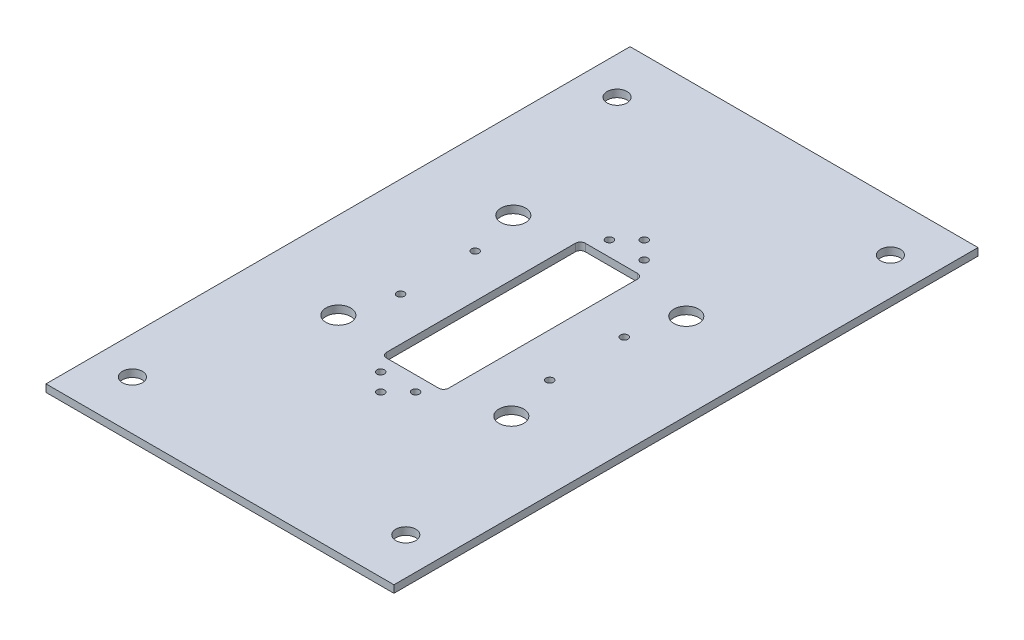
ISO-10303-21;
HEADER;
FILE_DESCRIPTION(('STEP AP214'),'2;1');
FILE_NAME('part.step','',(''),(''),'','','');
FILE_SCHEMA(('AUTOMOTIVE_DESIGN { 1 0 10303 214 1 1 1 1 }'));
ENDSEC;
DATA;
#1=APPLICATION_CONTEXT('core data for automotive mechanical design processes');
#2=APPLICATION_PROTOCOL_DEFINITION('international standard','automotive_design',2000,#1);
#3=PRODUCT_CONTEXT('',#1,'mechanical');
#4=PRODUCT('Part','Part','',(#3));
#5=PRODUCT_RELATED_PRODUCT_CATEGORY('part','',(#4));
#6=PRODUCT_DEFINITION_FORMATION('','',#4);
#7=PRODUCT_DEFINITION_CONTEXT('part definition',#1,'design');
#8=PRODUCT_DEFINITION('design','',#6,#7);
#9=PRODUCT_DEFINITION_SHAPE('','',#8);
#10=(LENGTH_UNIT() NAMED_UNIT(*) SI_UNIT(.MILLI.,.METRE.));
#11=(NAMED_UNIT(*) PLANE_ANGLE_UNIT() SI_UNIT($,.RADIAN.));
#12=(NAMED_UNIT(*) SI_UNIT($,.STERADIAN.) SOLID_ANGLE_UNIT());
#13=UNCERTAINTY_MEASURE_WITH_UNIT(LENGTH_MEASURE(1.E-05),#10,'distance_accuracy_value','');
#14=(GEOMETRIC_REPRESENTATION_CONTEXT(3) GLOBAL_UNCERTAINTY_ASSIGNED_CONTEXT((#13)) GLOBAL_UNIT_ASSIGNED_CONTEXT((#10,
#11,#12)) REPRESENTATION_CONTEXT('',''));
#15=CARTESIAN_POINT('',(0.,0.,0.));
#16=DIRECTION('',(0.,0.,1.));
#17=DIRECTION('',(1.,0.,0.));
#18=AXIS2_PLACEMENT_3D('',#15,#16,#17);
#19=CARTESIAN_POINT('',(0.,0.,0.));
#20=DIRECTION('',(0.,1.,0.));
#21=DIRECTION('',(0.,0.,1.));
#22=AXIS2_PLACEMENT_3D('',#19,#20,#21);
#23=PLANE('',#22);
#24=CARTESIAN_POINT('',(54.9999999999992,0.,97.7319085566605));
#25=DIRECTION('',(0.,-1.,0.));
#26=DIRECTION('',(0.,0.,-1.));
#27=AXIS2_PLACEMENT_3D('',#24,#25,#26);
#28=CIRCLE('',#27,4.0000000000027);
#29=CARTESIAN_POINT('',(54.9999999999992,0.,93.7319085566578));
#30=VERTEX_POINT('',#29);
#31=EDGE_CURVE('E216',#30,#30,#28,.F.);
#32=ORIENTED_EDGE('',*,*,#31,.T.);
#33=EDGE_LOOP('',(#32));
#34=FACE_BOUND('',#33,.T.);
#35=CARTESIAN_POINT('',(-55.0000000000008,0.,97.7319085566613));
#36=DIRECTION('',(0.,-1.,0.));
#37=DIRECTION('',(0.,0.,-1.));
#38=AXIS2_PLACEMENT_3D('',#35,#36,#37);
#39=CIRCLE('',#38,4.0000000000027);
#40=CARTESIAN_POINT('',(-55.0000000000008,0.,93.7319085566586));
#41=VERTEX_POINT('',#40);
#42=EDGE_CURVE('E19',#41,#41,#39,.F.);
#43=ORIENTED_EDGE('',*,*,#42,.T.);
#44=EDGE_LOOP('',(#43));
#45=FACE_BOUND('',#44,.T.);
#46=CARTESIAN_POINT('',(-55.0000000000028,0.,-97.2680914433387));
#47=DIRECTION('',(0.,-1.,0.));
#48=DIRECTION('',(0.,0.,-1.));
#49=AXIS2_PLACEMENT_3D('',#46,#47,#48);
#50=CIRCLE('',#49,4.0000000000027);
#51=CARTESIAN_POINT('',(-55.0000000000028,0.,-101.268091443341));
#52=VERTEX_POINT('',#51);
#53=EDGE_CURVE('E219',#52,#52,#50,.F.);
#54=ORIENTED_EDGE('',*,*,#53,.T.);
#55=EDGE_LOOP('',(#54));
#56=FACE_BOUND('',#55,.T.);
#57=CARTESIAN_POINT('',(54.9999999999958,0.,-97.2680914433395));
#58=DIRECTION('',(0.,-1.,0.));
#59=DIRECTION('',(0.,0.,-1.));
#60=AXIS2_PLACEMENT_3D('',#57,#58,#59);
#61=CIRCLE('',#60,4.00000000000403);
#62=CARTESIAN_POINT('',(54.9999999999958,0.,-101.268091443344));
#63=VERTEX_POINT('',#62);
#64=EDGE_CURVE('E272',#63,#63,#61,.F.);
#65=ORIENTED_EDGE('',*,*,#64,.T.);
#66=EDGE_LOOP('',(#65));
#67=FACE_BOUND('',#66,.T.);
#68=CARTESIAN_POINT('',(-35.1423190407129,0.,34.7416446339251));
#69=DIRECTION('',(0.,-1.,0.));
#70=DIRECTION('',(0.,0.,-1.));
#71=AXIS2_PLACEMENT_3D('',#68,#69,#70);
#72=CIRCLE('',#71,5.);
#73=CARTESIAN_POINT('',(-35.1423190407129,0.,29.7416446339251));
#74=VERTEX_POINT('',#73);
#75=EDGE_CURVE('E222',#74,#74,#72,.F.);
#76=ORIENTED_EDGE('',*,*,#75,.T.);
#77=EDGE_LOOP('',(#76));
#78=FACE_BOUND('',#77,.T.);
#79=CARTESIAN_POINT('',(34.8601227281781,0.,35.1393208369611));
#80=DIRECTION('',(0.,-1.,0.));
#81=DIRECTION('',(0.,0.,-1.));
#82=AXIS2_PLACEMENT_3D('',#79,#80,#81);
#83=CIRCLE('',#82,5.);
#84=CARTESIAN_POINT('',(34.8601227281781,0.,30.1393208369611));
#85=VERTEX_POINT('',#84);
#86=EDGE_CURVE('E270',#85,#85,#83,.F.);
#87=ORIENTED_EDGE('',*,*,#86,.T.);
#88=EDGE_LOOP('',(#87));
#89=FACE_BOUND('',#88,.T.);
#90=CARTESIAN_POINT('',(35.2577989313261,0.,-34.8631209321479));
#91=DIRECTION('',(0.,-1.,0.));
#92=DIRECTION('',(0.,0.,-1.));
#93=AXIS2_PLACEMENT_3D('',#90,#91,#92);
#94=CIRCLE('',#93,5.);
#95=CARTESIAN_POINT('',(35.2577989313261,0.,-39.8631209321479));
#96=VERTEX_POINT('',#95);
#97=EDGE_CURVE('E225',#96,#96,#94,.F.);
#98=ORIENTED_EDGE('',*,*,#97,.T.);
#99=EDGE_LOOP('',(#98));
#100=FACE_BOUND('',#99,.T.);
#101=CARTESIAN_POINT('',(-34.7446428377839,0.,-35.2607971352949));
#102=DIRECTION('',(0.,-1.,0.));
#103=DIRECTION('',(0.,0.,-1.));
#104=AXIS2_PLACEMENT_3D('',#101,#102,#103);
#105=CIRCLE('',#104,5.);
#106=CARTESIAN_POINT('',(-34.7446428377839,0.,-40.2607971352949));
#107=VERTEX_POINT('',#106);
#108=EDGE_CURVE('E267',#107,#107,#105,.F.);
#109=ORIENTED_EDGE('',*,*,#108,.T.);
#110=EDGE_LOOP('',(#109));
#111=FACE_BOUND('',#110,.T.);
#112=DIRECTION('',(-1.,0.,0.));
#113=VECTOR('',#112,1.);
#114=CARTESIAN_POINT('',(-10.5,0.,40.));
#115=LINE('',#114,#113);
#116=CARTESIAN_POINT('',(10.5,0.,40.));
#117=VERTEX_POINT('',#116);
#118=CARTESIAN_POINT('',(-10.5,0.,40.));
#119=VERTEX_POINT('',#118);
#120=EDGE_CURVE('E89',#117,#119,#115,.T.);
#121=ORIENTED_EDGE('',*,*,#120,.F.);
#122=CARTESIAN_POINT('',(10.5,0.,38.));
#123=DIRECTION('',(0.,-1.,0.));
#124=DIRECTION('',(0.,0.,-1.));
#125=AXIS2_PLACEMENT_3D('',#122,#123,#124);
#126=CIRCLE('',#125,2.);
#127=CARTESIAN_POINT('',(12.5,0.,38.));
#128=VERTEX_POINT('',#127);
#129=EDGE_CURVE('E228',#117,#128,#126,.F.);
#130=ORIENTED_EDGE('',*,*,#129,.T.);
#131=DIRECTION('',(0.,0.,1.));
#132=VECTOR('',#131,1.);
#133=CARTESIAN_POINT('',(12.5,0.,38.));
#134=LINE('',#133,#132);
#135=CARTESIAN_POINT('',(12.5,0.,-38.));
#136=VERTEX_POINT('',#135);
#137=EDGE_CURVE('E137',#136,#128,#134,.T.);
#138=ORIENTED_EDGE('',*,*,#137,.F.);
#139=CARTESIAN_POINT('',(10.5,0.,-38.));
#140=DIRECTION('',(0.,-1.,0.));
#141=DIRECTION('',(0.,0.,-1.));
#142=AXIS2_PLACEMENT_3D('',#139,#140,#141);
#143=CIRCLE('',#142,2.);
#144=CARTESIAN_POINT('',(10.5,0.,-40.));
#145=VERTEX_POINT('',#144);
#146=EDGE_CURVE('E140',#136,#145,#143,.F.);
#147=ORIENTED_EDGE('',*,*,#146,.T.);
#148=DIRECTION('',(1.,0.,0.));
#149=VECTOR('',#148,1.);
#150=CARTESIAN_POINT('',(-10.5,0.,-40.));
#151=LINE('',#150,#149);
#152=CARTESIAN_POINT('',(-10.5,0.,-40.));
#153=VERTEX_POINT('',#152);
#154=EDGE_CURVE('E141',#153,#145,#151,.T.);
#155=ORIENTED_EDGE('',*,*,#154,.F.);
#156=CARTESIAN_POINT('',(-10.5,0.,-38.));
#157=DIRECTION('',(0.,-1.,0.));
#158=DIRECTION('',(0.,0.,-1.));
#159=AXIS2_PLACEMENT_3D('',#156,#157,#158);
#160=CIRCLE('',#159,2.);
#161=CARTESIAN_POINT('',(-12.5,0.,-38.));
#162=VERTEX_POINT('',#161);
#163=EDGE_CURVE('E144',#153,#162,#160,.F.);
#164=ORIENTED_EDGE('',*,*,#163,.T.);
#165=DIRECTION('',(0.,0.,-1.));
#166=VECTOR('',#165,1.);
#167=CARTESIAN_POINT('',(-12.5,0.,38.));
#168=LINE('',#167,#166);
#169=CARTESIAN_POINT('',(-12.5,0.,38.));
#170=VERTEX_POINT('',#169);
#171=EDGE_CURVE('E83',#170,#162,#168,.T.);
#172=ORIENTED_EDGE('',*,*,#171,.F.);
#173=CARTESIAN_POINT('',(-10.5,0.,38.));
#174=DIRECTION('',(0.,-1.,0.));
#175=DIRECTION('',(0.,0.,-1.));
#176=AXIS2_PLACEMENT_3D('',#173,#174,#175);
#177=CIRCLE('',#176,2.);
#178=EDGE_CURVE('E146',#170,#119,#177,.F.);
#179=ORIENTED_EDGE('',*,*,#178,.T.);
#180=EDGE_LOOP('',(#121,#130,#138,#147,#155,#164,#172,#179));
#181=FACE_BOUND('',#180,.T.);
#182=DIRECTION('',(-1.,0.,0.));
#183=VECTOR('',#182,1.);
#184=CARTESIAN_POINT('',(-70.0000000000028,0.,117.5));
#185=LINE('',#184,#183);
#186=CARTESIAN_POINT('',(69.9999999999958,0.,117.5));
#187=VERTEX_POINT('',#186);
#188=CARTESIAN_POINT('',(-70.0000000000028,0.,117.5));
#189=VERTEX_POINT('',#188);
#190=EDGE_CURVE('E252',#187,#189,#185,.T.);
#191=ORIENTED_EDGE('',*,*,#190,.T.);
#192=DIRECTION('',(0.,0.,-1.));
#193=VECTOR('',#192,1.);
#194=CARTESIAN_POINT('',(-70.0000000000029,0.,-117.5));
#195=LINE('',#194,#193);
#196=CARTESIAN_POINT('',(-70.0000000000029,0.,-117.5));
#197=VERTEX_POINT('',#196);
#198=EDGE_CURVE('E123',#189,#197,#195,.T.);
#199=ORIENTED_EDGE('',*,*,#198,.T.);
#200=DIRECTION('',(1.,0.,0.));
#201=VECTOR('',#200,1.);
#202=CARTESIAN_POINT('',(-70.0000000000029,0.,-117.5));
#203=LINE('',#202,#201);
#204=CARTESIAN_POINT('',(69.9999999999958,0.,-117.5));
#205=VERTEX_POINT('',#204);
#206=EDGE_CURVE('E109',#197,#205,#203,.T.);
#207=ORIENTED_EDGE('',*,*,#206,.T.);
#208=DIRECTION('',(0.,0.,1.));
#209=VECTOR('',#208,1.);
#210=CARTESIAN_POINT('',(69.9999999999958,0.,-117.5));
#211=LINE('',#210,#209);
#212=EDGE_CURVE('E97',#205,#187,#211,.T.);
#213=ORIENTED_EDGE('',*,*,#212,.T.);
#214=EDGE_LOOP('',(#191,#199,#207,#213));
#215=FACE_BOUND('',#214,.T.);
#216=CARTESIAN_POINT('',(-29.9422468733205,0.,-15.1149545873327));
#217=DIRECTION('',(0.,-1.,0.));
#218=DIRECTION('',(0.,0.,-1.));
#219=AXIS2_PLACEMENT_3D('',#216,#217,#218);
#220=CIRCLE('',#219,1.50000000000005);
#221=CARTESIAN_POINT('',(-29.9422468733205,0.,-16.6149545873327));
#222=VERTEX_POINT('',#221);
#223=EDGE_CURVE('E120',#222,#222,#220,.F.);
#224=ORIENTED_EDGE('',*,*,#223,.T.);
#225=EDGE_LOOP('',(#224));
#226=FACE_BOUND('',#225,.T.);
#227=CARTESIAN_POINT('',(7.17638138932913,0.,-45.9728131633783));
#228=DIRECTION('',(0.,-1.,0.));
#229=DIRECTION('',(0.,0.,-1.));
#230=AXIS2_PLACEMENT_3D('',#227,#228,#229);
#231=CIRCLE('',#230,1.5);
#232=CARTESIAN_POINT('',(7.17638138932913,0.,-47.4728131633783));
#233=VERTEX_POINT('',#232);
#234=EDGE_CURVE('E249',#233,#233,#231,.F.);
#235=ORIENTED_EDGE('',*,*,#234,.T.);
#236=EDGE_LOOP('',(#235));
#237=FACE_BOUND('',#236,.T.);
#238=CARTESIAN_POINT('',(30.0577531266795,0.,-15.1149545873327));
#239=DIRECTION('',(0.,-1.,0.));
#240=DIRECTION('',(0.,0.,-1.));
#241=AXIS2_PLACEMENT_3D('',#238,#239,#240);
#242=CIRCLE('',#241,1.50000000000005);
#243=CARTESIAN_POINT('',(30.0577531266795,0.,-16.6149545873327));
#244=VERTEX_POINT('',#243);
#245=EDGE_CURVE('E255',#244,#244,#242,.F.);
#246=ORIENTED_EDGE('',*,*,#245,.T.);
#247=EDGE_LOOP('',(#246));
#248=FACE_BOUND('',#247,.T.);
#249=CARTESIAN_POINT('',(30.0577531266798,0.,14.8850454126673));
#250=DIRECTION('',(0.,-1.,0.));
#251=DIRECTION('',(0.,0.,-1.));
#252=AXIS2_PLACEMENT_3D('',#249,#250,#251);
#253=CIRCLE('',#252,1.50000000000006);
#254=CARTESIAN_POINT('',(30.0577531266798,0.,13.3850454126673));
#255=VERTEX_POINT('',#254);
#256=EDGE_CURVE('E246',#255,#255,#253,.F.);
#257=ORIENTED_EDGE('',*,*,#256,.T.);
#258=EDGE_LOOP('',(#257));
#259=FACE_BOUND('',#258,.T.);
#260=CARTESIAN_POINT('',(-29.9422468733202,0.,14.8850454126673));
#261=DIRECTION('',(0.,-1.,0.));
#262=DIRECTION('',(0.,0.,-1.));
#263=AXIS2_PLACEMENT_3D('',#260,#261,#262);
#264=CIRCLE('',#263,1.50000000000006);
#265=CARTESIAN_POINT('',(-29.9422468733202,0.,13.3850454126673));
#266=VERTEX_POINT('',#265);
#267=EDGE_CURVE('E258',#266,#266,#264,.F.);
#268=ORIENTED_EDGE('',*,*,#267,.T.);
#269=EDGE_LOOP('',(#268));
#270=FACE_BOUND('',#269,.T.);
#271=CARTESIAN_POINT('',(-6.82351563301263,0.,-46.026510126296));
#272=DIRECTION('',(0.,-1.,0.));
#273=DIRECTION('',(0.,0.,-1.));
#274=AXIS2_PLACEMENT_3D('',#271,#272,#273);
#275=CIRCLE('',#274,1.5);
#276=CARTESIAN_POINT('',(-6.82351563301263,0.,-47.526510126296));
#277=VERTEX_POINT('',#276);
#278=EDGE_CURVE('E243',#277,#277,#275,.F.);
#279=ORIENTED_EDGE('',*,*,#278,.T.);
#280=EDGE_LOOP('',(#279));
#281=FACE_BOUND('',#280,.T.);
#282=CARTESIAN_POINT('',(0.203281359617113,0.,-52.999610156008));
#283=DIRECTION('',(0.,-1.,0.));
#284=DIRECTION('',(0.,0.,-1.));
#285=AXIS2_PLACEMENT_3D('',#282,#283,#284);
#286=CIRCLE('',#285,1.49999999999999);
#287=CARTESIAN_POINT('',(0.203281359617113,0.,-54.499610156008));
#288=VERTEX_POINT('',#287);
#289=EDGE_CURVE('E261',#288,#288,#286,.F.);
#290=ORIENTED_EDGE('',*,*,#289,.T.);
#291=EDGE_LOOP('',(#290));
#292=FACE_BOUND('',#291,.T.);
#293=CARTESIAN_POINT('',(-6.82351563301263,0.,46.026510126296));
#294=DIRECTION('',(0.,-1.,0.));
#295=DIRECTION('',(0.,0.,-1.));
#296=AXIS2_PLACEMENT_3D('',#293,#294,#295);
#297=CIRCLE('',#296,1.5);
#298=CARTESIAN_POINT('',(-6.82351563301263,0.,44.526510126296));
#299=VERTEX_POINT('',#298);
#300=EDGE_CURVE('E240',#299,#299,#297,.F.);
#301=ORIENTED_EDGE('',*,*,#300,.T.);
#302=EDGE_LOOP('',(#301));
#303=FACE_BOUND('',#302,.T.);
#304=CARTESIAN_POINT('',(0.203281359617113,0.,52.999610156008));
#305=DIRECTION('',(0.,-1.,0.));
#306=DIRECTION('',(0.,0.,-1.));
#307=AXIS2_PLACEMENT_3D('',#304,#305,#306);
#308=CIRCLE('',#307,1.5);
#309=CARTESIAN_POINT('',(0.203281359617113,0.,51.499610156008));
#310=VERTEX_POINT('',#309);
#311=EDGE_CURVE('E264',#310,#310,#308,.F.);
#312=ORIENTED_EDGE('',*,*,#311,.T.);
#313=EDGE_LOOP('',(#312));
#314=FACE_BOUND('',#313,.T.);
#315=CARTESIAN_POINT('',(7.17638138932913,0.,45.9728131633783));
#316=DIRECTION('',(0.,-1.,0.));
#317=DIRECTION('',(0.,0.,-1.));
#318=AXIS2_PLACEMENT_3D('',#315,#316,#317);
#319=CIRCLE('',#318,1.5);
#320=CARTESIAN_POINT('',(7.17638138932913,0.,44.4728131633783));
#321=VERTEX_POINT('',#320);
#322=EDGE_CURVE('E136',#321,#321,#319,.F.);
#323=ORIENTED_EDGE('',*,*,#322,.T.);
#324=EDGE_LOOP('',(#323));
#325=FACE_BOUND('',#324,.T.);
#326=ADVANCED_FACE('F16',(#34,#45,#56,#67,#78,#89,#100,#111,#181,#215,#226,#237,#248,#259,#270,
#281,#292,#303,#314,#325),#23,.F.);
#327=CARTESIAN_POINT('',(-55.0000000000008,3.,97.7319085566613));
#328=DIRECTION('',(0.,-1.,0.));
#329=DIRECTION('',(0.,0.,-1.));
#330=AXIS2_PLACEMENT_3D('',#327,#328,#329);
#331=CYLINDRICAL_SURFACE('',#330,4.0000000000027);
#332=CARTESIAN_POINT('',(-55.0000000000008,3.,97.7319085566613));
#333=DIRECTION('',(0.,-1.,0.));
#334=DIRECTION('',(0.,0.,-1.));
#335=AXIS2_PLACEMENT_3D('',#332,#333,#334);
#336=CIRCLE('',#335,4.0000000000027);
#337=CARTESIAN_POINT('',(-55.0000000000008,3.,93.7319085566586));
#338=VERTEX_POINT('',#337);
#339=EDGE_CURVE('E213',#338,#338,#336,.T.);
#340=ORIENTED_EDGE('',*,*,#339,.F.);
#341=EDGE_LOOP('',(#340));
#342=FACE_BOUND('',#341,.T.);
#343=ORIENTED_EDGE('',*,*,#42,.F.);
#344=EDGE_LOOP('',(#343));
#345=FACE_BOUND('',#344,.T.);
#346=ADVANCED_FACE('F281',(#342,#345),#331,.F.);
#347=CARTESIAN_POINT('',(54.9999999999958,3.,-97.2680914433395));
#348=DIRECTION('',(0.,-1.,0.));
#349=DIRECTION('',(0.,0.,-1.));
#350=AXIS2_PLACEMENT_3D('',#347,#348,#349);
#351=CYLINDRICAL_SURFACE('',#350,4.00000000000403);
#352=CARTESIAN_POINT('',(54.9999999999958,3.,-97.2680914433395));
#353=DIRECTION('',(0.,-1.,0.));
#354=DIRECTION('',(0.,0.,-1.));
#355=AXIS2_PLACEMENT_3D('',#352,#353,#354);
#356=CIRCLE('',#355,4.00000000000403);
#357=CARTESIAN_POINT('',(54.9999999999958,3.,-101.268091443344));
#358=VERTEX_POINT('',#357);
#359=EDGE_CURVE('E210',#358,#358,#356,.T.);
#360=ORIENTED_EDGE('',*,*,#359,.F.);
#361=EDGE_LOOP('',(#360));
#362=FACE_BOUND('',#361,.T.);
#363=ORIENTED_EDGE('',*,*,#64,.F.);
#364=EDGE_LOOP('',(#363));
#365=FACE_BOUND('',#364,.T.);
#366=ADVANCED_FACE('F283',(#362,#365),#351,.F.);
#367=CARTESIAN_POINT('',(34.8601227281781,3.,35.1393208369611));
#368=DIRECTION('',(0.,-1.,0.));
#369=DIRECTION('',(0.,0.,-1.));
#370=AXIS2_PLACEMENT_3D('',#367,#368,#369);
#371=CYLINDRICAL_SURFACE('',#370,5.);
#372=CARTESIAN_POINT('',(34.8601227281781,3.,35.1393208369611));
#373=DIRECTION('',(0.,-1.,0.));
#374=DIRECTION('',(0.,0.,-1.));
#375=AXIS2_PLACEMENT_3D('',#372,#373,#374);
#376=CIRCLE('',#375,5.);
#377=CARTESIAN_POINT('',(34.8601227281781,3.,30.1393208369611));
#378=VERTEX_POINT('',#377);
#379=EDGE_CURVE('E207',#378,#378,#376,.T.);
#380=ORIENTED_EDGE('',*,*,#379,.F.);
#381=EDGE_LOOP('',(#380));
#382=FACE_BOUND('',#381,.T.);
#383=ORIENTED_EDGE('',*,*,#86,.F.);
#384=EDGE_LOOP('',(#383));
#385=FACE_BOUND('',#384,.T.);
#386=ADVANCED_FACE('F290',(#382,#385),#371,.F.);
#387=CARTESIAN_POINT('',(-34.7446428377839,3.,-35.2607971352949));
#388=DIRECTION('',(0.,-1.,0.));
#389=DIRECTION('',(0.,0.,-1.));
#390=AXIS2_PLACEMENT_3D('',#387,#388,#389);
#391=CYLINDRICAL_SURFACE('',#390,5.);
#392=CARTESIAN_POINT('',(-34.7446428377839,3.,-35.2607971352949));
#393=DIRECTION('',(0.,-1.,0.));
#394=DIRECTION('',(0.,0.,-1.));
#395=AXIS2_PLACEMENT_3D('',#392,#393,#394);
#396=CIRCLE('',#395,5.);
#397=CARTESIAN_POINT('',(-34.7446428377839,3.,-40.2607971352949));
#398=VERTEX_POINT('',#397);
#399=EDGE_CURVE('E204',#398,#398,#396,.T.);
#400=ORIENTED_EDGE('',*,*,#399,.F.);
#401=EDGE_LOOP('',(#400));
#402=FACE_BOUND('',#401,.T.);
#403=ORIENTED_EDGE('',*,*,#108,.F.);
#404=EDGE_LOOP('',(#403));
#405=FACE_BOUND('',#404,.T.);
#406=ADVANCED_FACE('F400',(#402,#405),#391,.F.);
#407=CARTESIAN_POINT('',(0.203281359617113,3.,52.999610156008));
#408=DIRECTION('',(0.,-1.,0.));
#409=DIRECTION('',(0.,0.,-1.));
#410=AXIS2_PLACEMENT_3D('',#407,#408,#409);
#411=CYLINDRICAL_SURFACE('',#410,1.5);
#412=CARTESIAN_POINT('',(0.203281359617113,3.,52.999610156008));
#413=DIRECTION('',(0.,-1.,0.));
#414=DIRECTION('',(0.,0.,-1.));
#415=AXIS2_PLACEMENT_3D('',#412,#413,#414);
#416=CIRCLE('',#415,1.5);
#417=CARTESIAN_POINT('',(0.203281359617113,3.,51.499610156008));
#418=VERTEX_POINT('',#417);
#419=EDGE_CURVE('E201',#418,#418,#416,.T.);
#420=ORIENTED_EDGE('',*,*,#419,.F.);
#421=EDGE_LOOP('',(#420));
#422=FACE_BOUND('',#421,.T.);
#423=ORIENTED_EDGE('',*,*,#311,.F.);
#424=EDGE_LOOP('',(#423));
#425=FACE_BOUND('',#424,.T.);
#426=ADVANCED_FACE('F396',(#422,#425),#411,.F.);
#427=CARTESIAN_POINT('',(0.203281359617113,3.,-52.999610156008));
#428=DIRECTION('',(0.,-1.,0.));
#429=DIRECTION('',(0.,0.,-1.));
#430=AXIS2_PLACEMENT_3D('',#427,#428,#429);
#431=CYLINDRICAL_SURFACE('',#430,1.49999999999999);
#432=CARTESIAN_POINT('',(0.203281359617113,3.,-52.999610156008));
#433=DIRECTION('',(0.,-1.,0.));
#434=DIRECTION('',(0.,0.,-1.));
#435=AXIS2_PLACEMENT_3D('',#432,#433,#434);
#436=CIRCLE('',#435,1.49999999999999);
#437=CARTESIAN_POINT('',(0.203281359617113,3.,-54.499610156008));
#438=VERTEX_POINT('',#437);
#439=EDGE_CURVE('E198',#438,#438,#436,.T.);
#440=ORIENTED_EDGE('',*,*,#439,.F.);
#441=EDGE_LOOP('',(#440));
#442=FACE_BOUND('',#441,.T.);
#443=ORIENTED_EDGE('',*,*,#289,.F.);
#444=EDGE_LOOP('',(#443));
#445=FACE_BOUND('',#444,.T.);
#446=ADVANCED_FACE('F392',(#442,#445),#431,.F.);
#447=CARTESIAN_POINT('',(-29.9422468733202,3.,14.8850454126673));
#448=DIRECTION('',(0.,-1.,0.));
#449=DIRECTION('',(0.,0.,-1.));
#450=AXIS2_PLACEMENT_3D('',#447,#448,#449);
#451=CYLINDRICAL_SURFACE('',#450,1.50000000000006);
#452=CARTESIAN_POINT('',(-29.9422468733202,3.,14.8850454126673));
#453=DIRECTION('',(0.,-1.,0.));
#454=DIRECTION('',(0.,0.,-1.));
#455=AXIS2_PLACEMENT_3D('',#452,#453,#454);
#456=CIRCLE('',#455,1.50000000000006);
#457=CARTESIAN_POINT('',(-29.9422468733202,3.,13.3850454126673));
#458=VERTEX_POINT('',#457);
#459=EDGE_CURVE('E195',#458,#458,#456,.T.);
#460=ORIENTED_EDGE('',*,*,#459,.F.);
#461=EDGE_LOOP('',(#460));
#462=FACE_BOUND('',#461,.T.);
#463=ORIENTED_EDGE('',*,*,#267,.F.);
#464=EDGE_LOOP('',(#463));
#465=FACE_BOUND('',#464,.T.);
#466=ADVANCED_FACE('F388',(#462,#465),#451,.F.);
#467=CARTESIAN_POINT('',(30.0577531266795,3.,-15.1149545873327));
#468=DIRECTION('',(0.,-1.,0.));
#469=DIRECTION('',(0.,0.,-1.));
#470=AXIS2_PLACEMENT_3D('',#467,#468,#469);
#471=CYLINDRICAL_SURFACE('',#470,1.50000000000005);
#472=CARTESIAN_POINT('',(30.0577531266795,3.,-15.1149545873327));
#473=DIRECTION('',(0.,-1.,0.));
#474=DIRECTION('',(0.,0.,-1.));
#475=AXIS2_PLACEMENT_3D('',#472,#473,#474);
#476=CIRCLE('',#475,1.50000000000005);
#477=CARTESIAN_POINT('',(30.0577531266795,3.,-16.6149545873327));
#478=VERTEX_POINT('',#477);
#479=EDGE_CURVE('E192',#478,#478,#476,.T.);
#480=ORIENTED_EDGE('',*,*,#479,.F.);
#481=EDGE_LOOP('',(#480));
#482=FACE_BOUND('',#481,.T.);
#483=ORIENTED_EDGE('',*,*,#245,.F.);
#484=EDGE_LOOP('',(#483));
#485=FACE_BOUND('',#484,.T.);
#486=ADVANCED_FACE('F384',(#482,#485),#471,.F.);
#487=CARTESIAN_POINT('',(-29.9422468733205,3.,-15.1149545873327));
#488=DIRECTION('',(0.,-1.,0.));
#489=DIRECTION('',(0.,0.,-1.));
#490=AXIS2_PLACEMENT_3D('',#487,#488,#489);
#491=CYLINDRICAL_SURFACE('',#490,1.50000000000005);
#492=CARTESIAN_POINT('',(-29.9422468733205,3.,-15.1149545873327));
#493=DIRECTION('',(0.,-1.,0.));
#494=DIRECTION('',(0.,0.,-1.));
#495=AXIS2_PLACEMENT_3D('',#492,#493,#494);
#496=CIRCLE('',#495,1.50000000000005);
#497=CARTESIAN_POINT('',(-29.9422468733205,3.,-16.6149545873327));
#498=VERTEX_POINT('',#497);
#499=EDGE_CURVE('E188',#498,#498,#496,.T.);
#500=ORIENTED_EDGE('',*,*,#499,.F.);
#501=EDGE_LOOP('',(#500));
#502=FACE_BOUND('',#501,.T.);
#503=ORIENTED_EDGE('',*,*,#223,.F.);
#504=EDGE_LOOP('',(#503));
#505=FACE_BOUND('',#504,.T.);
#506=ADVANCED_FACE('F381',(#502,#505),#491,.F.);
#507=CARTESIAN_POINT('',(69.9999999999958,3.,-117.5));
#508=DIRECTION('',(-1.,0.,0.));
#509=DIRECTION('',(0.,0.,1.));
#510=AXIS2_PLACEMENT_3D('',#507,#508,#509);
#511=PLANE('',#510);
#512=DIRECTION('',(0.,1.,0.));
#513=VECTOR('',#512,1.);
#514=CARTESIAN_POINT('',(69.9999999999958,3.,-117.5));
#515=LINE('',#514,#513);
#516=CARTESIAN_POINT('',(69.9999999999958,3.,-117.5));
#517=VERTEX_POINT('',#516);
#518=EDGE_CURVE('E115',#205,#517,#515,.T.);
#519=ORIENTED_EDGE('',*,*,#518,.T.);
#520=DIRECTION('',(0.,0.,1.));
#521=VECTOR('',#520,1.);
#522=CARTESIAN_POINT('',(69.9999999999958,3.,0.));
#523=LINE('',#522,#521);
#524=CARTESIAN_POINT('',(69.9999999999958,3.,117.5));
#525=VERTEX_POINT('',#524);
#526=EDGE_CURVE('E191',#525,#517,#523,.F.);
#527=ORIENTED_EDGE('',*,*,#526,.F.);
#528=DIRECTION('',(0.,1.,0.));
#529=VECTOR('',#528,1.);
#530=CARTESIAN_POINT('',(69.9999999999958,3.,117.5));
#531=LINE('',#530,#529);
#532=EDGE_CURVE('E118',#525,#187,#531,.F.);
#533=ORIENTED_EDGE('',*,*,#532,.T.);
#534=ORIENTED_EDGE('',*,*,#212,.F.);
#535=EDGE_LOOP('',(#519,#527,#533,#534));
#536=FACE_BOUND('',#535,.T.);
#537=ADVANCED_FACE('F113',(#536),#511,.F.);
#538=CARTESIAN_POINT('',(-70.0000000000029,3.,-117.5));
#539=DIRECTION('',(0.,0.,1.));
#540=DIRECTION('',(1.,0.,0.));
#541=AXIS2_PLACEMENT_3D('',#538,#539,#540);
#542=PLANE('',#541);
#543=DIRECTION('',(0.,1.,0.));
#544=VECTOR('',#543,1.);
#545=CARTESIAN_POINT('',(-70.0000000000029,3.,-117.5));
#546=LINE('',#545,#544);
#547=CARTESIAN_POINT('',(-70.0000000000029,3.,-117.5));
#548=VERTEX_POINT('',#547);
#549=EDGE_CURVE('E125',#197,#548,#546,.T.);
#550=ORIENTED_EDGE('',*,*,#549,.T.);
#551=DIRECTION('',(1.,0.,0.));
#552=VECTOR('',#551,1.);
#553=CARTESIAN_POINT('',(0.,3.,-117.5));
#554=LINE('',#553,#552);
#555=EDGE_CURVE('E129',#517,#548,#554,.F.);
#556=ORIENTED_EDGE('',*,*,#555,.F.);
#557=ORIENTED_EDGE('',*,*,#518,.F.);
#558=ORIENTED_EDGE('',*,*,#206,.F.);
#559=EDGE_LOOP('',(#550,#556,#557,#558));
#560=FACE_BOUND('',#559,.T.);
#561=ADVANCED_FACE('F127',(#560),#542,.F.);
#562=CARTESIAN_POINT('',(-70.0000000000029,3.,-117.5));
#563=DIRECTION('',(1.,0.,0.));
#564=DIRECTION('',(0.,0.,-1.));
#565=AXIS2_PLACEMENT_3D('',#562,#563,#564);
#566=PLANE('',#565);
#567=DIRECTION('',(0.,1.,0.));
#568=VECTOR('',#567,1.);
#569=CARTESIAN_POINT('',(-70.0000000000028,3.,117.5));
#570=LINE('',#569,#568);
#571=CARTESIAN_POINT('',(-70.0000000000028,3.,117.5));
#572=VERTEX_POINT('',#571);
#573=EDGE_CURVE('E438',#189,#572,#570,.T.);
#574=ORIENTED_EDGE('',*,*,#573,.T.);
#575=DIRECTION('',(0.,0.,1.));
#576=VECTOR('',#575,1.);
#577=CARTESIAN_POINT('',(-70.0000000000029,3.,0.));
#578=LINE('',#577,#576);
#579=EDGE_CURVE('E445',#548,#572,#578,.T.);
#580=ORIENTED_EDGE('',*,*,#579,.F.);
#581=ORIENTED_EDGE('',*,*,#549,.F.);
#582=ORIENTED_EDGE('',*,*,#198,.F.);
#583=EDGE_LOOP('',(#574,#580,#581,#582));
#584=FACE_BOUND('',#583,.T.);
#585=ADVANCED_FACE('F372',(#584),#566,.F.);
#586=CARTESIAN_POINT('',(-70.0000000000028,3.,117.5));
#587=DIRECTION('',(0.,0.,-1.));
#588=DIRECTION('',(-1.,0.,0.));
#589=AXIS2_PLACEMENT_3D('',#586,#587,#588);
#590=PLANE('',#589);
#591=ORIENTED_EDGE('',*,*,#532,.F.);
#592=DIRECTION('',(1.,0.,0.));
#593=VECTOR('',#592,1.);
#594=CARTESIAN_POINT('',(0.,3.,117.5));
#595=LINE('',#594,#593);
#596=EDGE_CURVE('E187',#572,#525,#595,.T.);
#597=ORIENTED_EDGE('',*,*,#596,.F.);
#598=ORIENTED_EDGE('',*,*,#573,.F.);
#599=ORIENTED_EDGE('',*,*,#190,.F.);
#600=EDGE_LOOP('',(#591,#597,#598,#599));
#601=FACE_BOUND('',#600,.T.);
#602=ADVANCED_FACE('F368',(#601),#590,.F.);
#603=CARTESIAN_POINT('',(7.17638138932913,3.,-45.9728131633783));
#604=DIRECTION('',(0.,-1.,0.));
#605=DIRECTION('',(0.,0.,-1.));
#606=AXIS2_PLACEMENT_3D('',#603,#604,#605);
#607=CYLINDRICAL_SURFACE('',#606,1.5);
#608=CARTESIAN_POINT('',(7.17638138932913,3.,-45.9728131633783));
#609=DIRECTION('',(0.,-1.,0.));
#610=DIRECTION('',(0.,0.,-1.));
#611=AXIS2_PLACEMENT_3D('',#608,#609,#610);
#612=CIRCLE('',#611,1.5);
#613=CARTESIAN_POINT('',(7.17638138932913,3.,-47.4728131633783));
#614=VERTEX_POINT('',#613);
#615=EDGE_CURVE('E184',#614,#614,#612,.T.);
#616=ORIENTED_EDGE('',*,*,#615,.F.);
#617=EDGE_LOOP('',(#616));
#618=FACE_BOUND('',#617,.T.);
#619=ORIENTED_EDGE('',*,*,#234,.F.);
#620=EDGE_LOOP('',(#619));
#621=FACE_BOUND('',#620,.T.);
#622=ADVANCED_FACE('F364',(#618,#621),#607,.F.);
#623=CARTESIAN_POINT('',(30.0577531266798,3.,14.8850454126673));
#624=DIRECTION('',(0.,-1.,0.));
#625=DIRECTION('',(0.,0.,-1.));
#626=AXIS2_PLACEMENT_3D('',#623,#624,#625);
#627=CYLINDRICAL_SURFACE('',#626,1.50000000000006);
#628=CARTESIAN_POINT('',(30.0577531266798,3.,14.8850454126673));
#629=DIRECTION('',(0.,-1.,0.));
#630=DIRECTION('',(0.,0.,-1.));
#631=AXIS2_PLACEMENT_3D('',#628,#629,#630);
#632=CIRCLE('',#631,1.50000000000006);
#633=CARTESIAN_POINT('',(30.0577531266798,3.,13.3850454126673));
#634=VERTEX_POINT('',#633);
#635=EDGE_CURVE('E181',#634,#634,#632,.T.);
#636=ORIENTED_EDGE('',*,*,#635,.F.);
#637=EDGE_LOOP('',(#636));
#638=FACE_BOUND('',#637,.T.);
#639=ORIENTED_EDGE('',*,*,#256,.F.);
#640=EDGE_LOOP('',(#639));
#641=FACE_BOUND('',#640,.T.);
#642=ADVANCED_FACE('F360',(#638,#641),#627,.F.);
#643=CARTESIAN_POINT('',(-6.82351563301263,3.,-46.026510126296));
#644=DIRECTION('',(0.,-1.,0.));
#645=DIRECTION('',(0.,0.,-1.));
#646=AXIS2_PLACEMENT_3D('',#643,#644,#645);
#647=CYLINDRICAL_SURFACE('',#646,1.5);
#648=CARTESIAN_POINT('',(-6.82351563301263,3.,-46.026510126296));
#649=DIRECTION('',(0.,-1.,0.));
#650=DIRECTION('',(0.,0.,-1.));
#651=AXIS2_PLACEMENT_3D('',#648,#649,#650);
#652=CIRCLE('',#651,1.5);
#653=CARTESIAN_POINT('',(-6.82351563301263,3.,-47.526510126296));
#654=VERTEX_POINT('',#653);
#655=EDGE_CURVE('E178',#654,#654,#652,.T.);
#656=ORIENTED_EDGE('',*,*,#655,.F.);
#657=EDGE_LOOP('',(#656));
#658=FACE_BOUND('',#657,.T.);
#659=ORIENTED_EDGE('',*,*,#278,.F.);
#660=EDGE_LOOP('',(#659));
#661=FACE_BOUND('',#660,.T.);
#662=ADVANCED_FACE('F356',(#658,#661),#647,.F.);
#663=CARTESIAN_POINT('',(-6.82351563301263,3.,46.026510126296));
#664=DIRECTION('',(0.,-1.,0.));
#665=DIRECTION('',(0.,0.,-1.));
#666=AXIS2_PLACEMENT_3D('',#663,#664,#665);
#667=CYLINDRICAL_SURFACE('',#666,1.5);
#668=CARTESIAN_POINT('',(-6.82351563301263,3.,46.026510126296));
#669=DIRECTION('',(0.,-1.,0.));
#670=DIRECTION('',(0.,0.,-1.));
#671=AXIS2_PLACEMENT_3D('',#668,#669,#670);
#672=CIRCLE('',#671,1.5);
#673=CARTESIAN_POINT('',(-6.82351563301263,3.,44.526510126296));
#674=VERTEX_POINT('',#673);
#675=EDGE_CURVE('E175',#674,#674,#672,.T.);
#676=ORIENTED_EDGE('',*,*,#675,.F.);
#677=EDGE_LOOP('',(#676));
#678=FACE_BOUND('',#677,.T.);
#679=ORIENTED_EDGE('',*,*,#300,.F.);
#680=EDGE_LOOP('',(#679));
#681=FACE_BOUND('',#680,.T.);
#682=ADVANCED_FACE('F352',(#678,#681),#667,.F.);
#683=CARTESIAN_POINT('',(7.17638138932913,3.,45.9728131633783));
#684=DIRECTION('',(0.,-1.,0.));
#685=DIRECTION('',(0.,0.,-1.));
#686=AXIS2_PLACEMENT_3D('',#683,#684,#685);
#687=CYLINDRICAL_SURFACE('',#686,1.5);
#688=CARTESIAN_POINT('',(7.17638138932913,3.,45.9728131633783));
#689=DIRECTION('',(0.,-1.,0.));
#690=DIRECTION('',(0.,0.,-1.));
#691=AXIS2_PLACEMENT_3D('',#688,#689,#690);
#692=CIRCLE('',#691,1.5);
#693=CARTESIAN_POINT('',(7.17638138932913,3.,44.4728131633783));
#694=VERTEX_POINT('',#693);
#695=EDGE_CURVE('E172',#694,#694,#692,.T.);
#696=ORIENTED_EDGE('',*,*,#695,.F.);
#697=EDGE_LOOP('',(#696));
#698=FACE_BOUND('',#697,.T.);
#699=ORIENTED_EDGE('',*,*,#322,.F.);
#700=EDGE_LOOP('',(#699));
#701=FACE_BOUND('',#700,.T.);
#702=ADVANCED_FACE('F349',(#698,#701),#687,.F.);
#703=CARTESIAN_POINT('',(-10.5,3.,40.));
#704=DIRECTION('',(0.,0.,-1.));
#705=DIRECTION('',(-1.,0.,0.));
#706=AXIS2_PLACEMENT_3D('',#703,#704,#705);
#707=PLANE('',#706);
#708=DIRECTION('',(1.,0.,0.));
#709=VECTOR('',#708,1.);
#710=CARTESIAN_POINT('',(0.,3.,40.));
#711=LINE('',#710,#709);
#712=CARTESIAN_POINT('',(10.5,3.,40.));
#713=VERTEX_POINT('',#712);
#714=CARTESIAN_POINT('',(-10.5,3.,40.));
#715=VERTEX_POINT('',#714);
#716=EDGE_CURVE('E171',#713,#715,#711,.F.);
#717=ORIENTED_EDGE('',*,*,#716,.F.);
#718=DIRECTION('',(0.,-1.,0.));
#719=VECTOR('',#718,1.);
#720=CARTESIAN_POINT('',(10.5,3.,40.));
#721=LINE('',#720,#719);
#722=EDGE_CURVE('E231',#713,#117,#721,.T.);
#723=ORIENTED_EDGE('',*,*,#722,.T.);
#724=ORIENTED_EDGE('',*,*,#120,.T.);
#725=DIRECTION('',(0.,-1.,0.));
#726=VECTOR('',#725,1.);
#727=CARTESIAN_POINT('',(-10.5,3.,40.));
#728=LINE('',#727,#726);
#729=EDGE_CURVE('E135',#119,#715,#728,.F.);
#730=ORIENTED_EDGE('',*,*,#729,.T.);
#731=EDGE_LOOP('',(#717,#723,#724,#730));
#732=FACE_BOUND('',#731,.T.);
#733=ADVANCED_FACE('F345',(#732),#707,.T.);
#734=CARTESIAN_POINT('',(-10.5,3.,38.));
#735=DIRECTION('',(0.,-1.,0.));
#736=DIRECTION('',(0.,0.,-1.));
#737=AXIS2_PLACEMENT_3D('',#734,#735,#736);
#738=CYLINDRICAL_SURFACE('',#737,2.);
#739=DIRECTION('',(0.,1.,0.));
#740=VECTOR('',#739,1.);
#741=CARTESIAN_POINT('',(-12.5,3.,38.));
#742=LINE('',#741,#740);
#743=CARTESIAN_POINT('',(-12.5,3.,38.));
#744=VERTEX_POINT('',#743);
#745=EDGE_CURVE('E145',#744,#170,#742,.F.);
#746=ORIENTED_EDGE('',*,*,#745,.F.);
#747=CARTESIAN_POINT('',(-10.5,3.,38.));
#748=DIRECTION('',(0.,-1.,0.));
#749=DIRECTION('',(0.,0.,-1.));
#750=AXIS2_PLACEMENT_3D('',#747,#748,#749);
#751=CIRCLE('',#750,2.);
#752=EDGE_CURVE('E168',#715,#744,#751,.T.);
#753=ORIENTED_EDGE('',*,*,#752,.F.);
#754=ORIENTED_EDGE('',*,*,#729,.F.);
#755=ORIENTED_EDGE('',*,*,#178,.F.);
#756=EDGE_LOOP('',(#746,#753,#754,#755));
#757=FACE_BOUND('',#756,.T.);
#758=ADVANCED_FACE('F341',(#757),#738,.F.);
#759=CARTESIAN_POINT('',(-12.5,3.,38.));
#760=DIRECTION('',(1.,0.,0.));
#761=DIRECTION('',(0.,0.,-1.));
#762=AXIS2_PLACEMENT_3D('',#759,#760,#761);
#763=PLANE('',#762);
#764=DIRECTION('',(0.,0.,1.));
#765=VECTOR('',#764,1.);
#766=CARTESIAN_POINT('',(-12.5,3.,0.));
#767=LINE('',#766,#765);
#768=CARTESIAN_POINT('',(-12.5,3.,-38.));
#769=VERTEX_POINT('',#768);
#770=EDGE_CURVE('E167',#744,#769,#767,.F.);
#771=ORIENTED_EDGE('',*,*,#770,.F.);
#772=ORIENTED_EDGE('',*,*,#745,.T.);
#773=ORIENTED_EDGE('',*,*,#171,.T.);
#774=DIRECTION('',(0.,-1.,0.));
#775=VECTOR('',#774,1.);
#776=CARTESIAN_POINT('',(-12.5,3.,-38.));
#777=LINE('',#776,#775);
#778=EDGE_CURVE('E236',#162,#769,#777,.F.);
#779=ORIENTED_EDGE('',*,*,#778,.T.);
#780=EDGE_LOOP('',(#771,#772,#773,#779));
#781=FACE_BOUND('',#780,.T.);
#782=ADVANCED_FACE('F337',(#781),#763,.T.);
#783=CARTESIAN_POINT('',(-10.5,3.,-38.));
#784=DIRECTION('',(0.,-1.,0.));
#785=DIRECTION('',(0.,0.,-1.));
#786=AXIS2_PLACEMENT_3D('',#783,#784,#785);
#787=CYLINDRICAL_SURFACE('',#786,2.);
#788=DIRECTION('',(0.,1.,0.));
#789=VECTOR('',#788,1.);
#790=CARTESIAN_POINT('',(-10.5,3.,-40.));
#791=LINE('',#790,#789);
#792=CARTESIAN_POINT('',(-10.5,3.,-40.));
#793=VERTEX_POINT('',#792);
#794=EDGE_CURVE('E143',#793,#153,#791,.F.);
#795=ORIENTED_EDGE('',*,*,#794,.F.);
#796=CARTESIAN_POINT('',(-10.5,3.,-38.));
#797=DIRECTION('',(0.,-1.,0.));
#798=DIRECTION('',(0.,0.,-1.));
#799=AXIS2_PLACEMENT_3D('',#796,#797,#798);
#800=CIRCLE('',#799,2.);
#801=EDGE_CURVE('E164',#769,#793,#800,.T.);
#802=ORIENTED_EDGE('',*,*,#801,.F.);
#803=ORIENTED_EDGE('',*,*,#778,.F.);
#804=ORIENTED_EDGE('',*,*,#163,.F.);
#805=EDGE_LOOP('',(#795,#802,#803,#804));
#806=FACE_BOUND('',#805,.T.);
#807=ADVANCED_FACE('F333',(#806),#787,.F.);
#808=CARTESIAN_POINT('',(-10.5,3.,-40.));
#809=DIRECTION('',(0.,0.,1.));
#810=DIRECTION('',(1.,0.,0.));
#811=AXIS2_PLACEMENT_3D('',#808,#809,#810);
#812=PLANE('',#811);
#813=DIRECTION('',(1.,0.,0.));
#814=VECTOR('',#813,1.);
#815=CARTESIAN_POINT('',(0.,3.,-40.));
#816=LINE('',#815,#814);
#817=CARTESIAN_POINT('',(10.5,3.,-40.));
#818=VERTEX_POINT('',#817);
#819=EDGE_CURVE('E163',#793,#818,#816,.T.);
#820=ORIENTED_EDGE('',*,*,#819,.F.);
#821=ORIENTED_EDGE('',*,*,#794,.T.);
#822=ORIENTED_EDGE('',*,*,#154,.T.);
#823=DIRECTION('',(0.,-1.,0.));
#824=VECTOR('',#823,1.);
#825=CARTESIAN_POINT('',(10.5,3.,-40.));
#826=LINE('',#825,#824);
#827=EDGE_CURVE('E234',#145,#818,#826,.F.);
#828=ORIENTED_EDGE('',*,*,#827,.T.);
#829=EDGE_LOOP('',(#820,#821,#822,#828));
#830=FACE_BOUND('',#829,.T.);
#831=ADVANCED_FACE('F329',(#830),#812,.T.);
#832=CARTESIAN_POINT('',(10.5,3.,-38.));
#833=DIRECTION('',(0.,-1.,0.));
#834=DIRECTION('',(0.,0.,-1.));
#835=AXIS2_PLACEMENT_3D('',#832,#833,#834);
#836=CYLINDRICAL_SURFACE('',#835,2.);
#837=DIRECTION('',(0.,1.,0.));
#838=VECTOR('',#837,1.);
#839=CARTESIAN_POINT('',(12.5,3.,-38.));
#840=LINE('',#839,#838);
#841=CARTESIAN_POINT('',(12.5,3.,-38.));
#842=VERTEX_POINT('',#841);
#843=EDGE_CURVE('E139',#842,#136,#840,.F.);
#844=ORIENTED_EDGE('',*,*,#843,.F.);
#845=CARTESIAN_POINT('',(10.5,3.,-38.));
#846=DIRECTION('',(0.,-1.,0.));
#847=DIRECTION('',(0.,0.,-1.));
#848=AXIS2_PLACEMENT_3D('',#845,#846,#847);
#849=CIRCLE('',#848,2.);
#850=EDGE_CURVE('E160',#818,#842,#849,.T.);
#851=ORIENTED_EDGE('',*,*,#850,.F.);
#852=ORIENTED_EDGE('',*,*,#827,.F.);
#853=ORIENTED_EDGE('',*,*,#146,.F.);
#854=EDGE_LOOP('',(#844,#851,#852,#853));
#855=FACE_BOUND('',#854,.T.);
#856=ADVANCED_FACE('F326',(#855),#836,.F.);
#857=CARTESIAN_POINT('',(12.5,3.,38.));
#858=DIRECTION('',(-1.,0.,0.));
#859=DIRECTION('',(0.,0.,1.));
#860=AXIS2_PLACEMENT_3D('',#857,#858,#859);
#861=PLANE('',#860);
#862=DIRECTION('',(0.,0.,1.));
#863=VECTOR('',#862,1.);
#864=CARTESIAN_POINT('',(12.5,3.,0.));
#865=LINE('',#864,#863);
#866=CARTESIAN_POINT('',(12.5,3.,38.));
#867=VERTEX_POINT('',#866);
#868=EDGE_CURVE('E159',#842,#867,#865,.T.);
#869=ORIENTED_EDGE('',*,*,#868,.F.);
#870=ORIENTED_EDGE('',*,*,#843,.T.);
#871=ORIENTED_EDGE('',*,*,#137,.T.);
#872=DIRECTION('',(0.,-1.,0.));
#873=VECTOR('',#872,1.);
#874=CARTESIAN_POINT('',(12.5,3.,38.));
#875=LINE('',#874,#873);
#876=EDGE_CURVE('E34',#128,#867,#875,.F.);
#877=ORIENTED_EDGE('',*,*,#876,.T.);
#878=EDGE_LOOP('',(#869,#870,#871,#877));
#879=FACE_BOUND('',#878,.T.);
#880=ADVANCED_FACE('F322',(#879),#861,.T.);
#881=CARTESIAN_POINT('',(10.5,3.,38.));
#882=DIRECTION('',(0.,-1.,0.));
#883=DIRECTION('',(0.,0.,-1.));
#884=AXIS2_PLACEMENT_3D('',#881,#882,#883);
#885=CYLINDRICAL_SURFACE('',#884,2.);
#886=ORIENTED_EDGE('',*,*,#722,.F.);
#887=CARTESIAN_POINT('',(10.5,3.,38.));
#888=DIRECTION('',(0.,-1.,0.));
#889=DIRECTION('',(0.,0.,-1.));
#890=AXIS2_PLACEMENT_3D('',#887,#888,#889);
#891=CIRCLE('',#890,2.);
#892=EDGE_CURVE('E156',#867,#713,#891,.T.);
#893=ORIENTED_EDGE('',*,*,#892,.F.);
#894=ORIENTED_EDGE('',*,*,#876,.F.);
#895=ORIENTED_EDGE('',*,*,#129,.F.);
#896=EDGE_LOOP('',(#886,#893,#894,#895));
#897=FACE_BOUND('',#896,.T.);
#898=ADVANCED_FACE('F318',(#897),#885,.F.);
#899=CARTESIAN_POINT('',(35.2577989313261,3.,-34.8631209321479));
#900=DIRECTION('',(0.,-1.,0.));
#901=DIRECTION('',(0.,0.,-1.));
#902=AXIS2_PLACEMENT_3D('',#899,#900,#901);
#903=CYLINDRICAL_SURFACE('',#902,5.);
#904=CARTESIAN_POINT('',(35.2577989313261,3.,-34.8631209321479));
#905=DIRECTION('',(0.,-1.,0.));
#906=DIRECTION('',(0.,0.,-1.));
#907=AXIS2_PLACEMENT_3D('',#904,#905,#906);
#908=CIRCLE('',#907,5.);
#909=CARTESIAN_POINT('',(35.2577989313261,3.,-39.8631209321479));
#910=VERTEX_POINT('',#909);
#911=EDGE_CURVE('E153',#910,#910,#908,.T.);
#912=ORIENTED_EDGE('',*,*,#911,.F.);
#913=EDGE_LOOP('',(#912));
#914=FACE_BOUND('',#913,.T.);
#915=ORIENTED_EDGE('',*,*,#97,.F.);
#916=EDGE_LOOP('',(#915));
#917=FACE_BOUND('',#916,.T.);
#918=ADVANCED_FACE('F314',(#914,#917),#903,.F.);
#919=CARTESIAN_POINT('',(-35.1423190407129,3.,34.7416446339251));
#920=DIRECTION('',(0.,-1.,0.));
#921=DIRECTION('',(0.,0.,-1.));
#922=AXIS2_PLACEMENT_3D('',#919,#920,#921);
#923=CYLINDRICAL_SURFACE('',#922,5.);
#924=CARTESIAN_POINT('',(-35.1423190407129,3.,34.7416446339251));
#925=DIRECTION('',(0.,-1.,0.));
#926=DIRECTION('',(0.,0.,-1.));
#927=AXIS2_PLACEMENT_3D('',#924,#925,#926);
#928=CIRCLE('',#927,5.);
#929=CARTESIAN_POINT('',(-35.1423190407129,3.,29.7416446339251));
#930=VERTEX_POINT('',#929);
#931=EDGE_CURVE('E150',#930,#930,#928,.T.);
#932=ORIENTED_EDGE('',*,*,#931,.F.);
#933=EDGE_LOOP('',(#932));
#934=FACE_BOUND('',#933,.T.);
#935=ORIENTED_EDGE('',*,*,#75,.F.);
#936=EDGE_LOOP('',(#935));
#937=FACE_BOUND('',#936,.T.);
#938=ADVANCED_FACE('F310',(#934,#937),#923,.F.);
#939=CARTESIAN_POINT('',(-55.0000000000028,3.,-97.2680914433387));
#940=DIRECTION('',(0.,-1.,0.));
#941=DIRECTION('',(0.,0.,-1.));
#942=AXIS2_PLACEMENT_3D('',#939,#940,#941);
#943=CYLINDRICAL_SURFACE('',#942,4.0000000000027);
#944=CARTESIAN_POINT('',(-55.0000000000028,3.,-97.2680914433387));
#945=DIRECTION('',(0.,-1.,0.));
#946=DIRECTION('',(0.,0.,-1.));
#947=AXIS2_PLACEMENT_3D('',#944,#945,#946);
#948=CIRCLE('',#947,4.0000000000027);
#949=CARTESIAN_POINT('',(-55.0000000000028,3.,-101.268091443341));
#950=VERTEX_POINT('',#949);
#951=EDGE_CURVE('E25',#950,#950,#948,.T.);
#952=ORIENTED_EDGE('',*,*,#951,.F.);
#953=EDGE_LOOP('',(#952));
#954=FACE_BOUND('',#953,.T.);
#955=ORIENTED_EDGE('',*,*,#53,.F.);
#956=EDGE_LOOP('',(#955));
#957=FACE_BOUND('',#956,.T.);
#958=ADVANCED_FACE('F303',(#954,#957),#943,.F.);
#959=CARTESIAN_POINT('',(54.9999999999992,3.,97.7319085566605));
#960=DIRECTION('',(0.,-1.,0.));
#961=DIRECTION('',(0.,0.,-1.));
#962=AXIS2_PLACEMENT_3D('',#959,#960,#961);
#963=CYLINDRICAL_SURFACE('',#962,4.0000000000027);
#964=CARTESIAN_POINT('',(54.9999999999992,3.,97.7319085566605));
#965=DIRECTION('',(0.,-1.,0.));
#966=DIRECTION('',(0.,0.,-1.));
#967=AXIS2_PLACEMENT_3D('',#964,#965,#966);
#968=CIRCLE('',#967,4.0000000000027);
#969=CARTESIAN_POINT('',(54.9999999999992,3.,93.7319085566578));
#970=VERTEX_POINT('',#969);
#971=EDGE_CURVE('E11',#970,#970,#968,.T.);
#972=ORIENTED_EDGE('',*,*,#971,.F.);
#973=EDGE_LOOP('',(#972));
#974=FACE_BOUND('',#973,.T.);
#975=ORIENTED_EDGE('',*,*,#31,.F.);
#976=EDGE_LOOP('',(#975));
#977=FACE_BOUND('',#976,.T.);
#978=ADVANCED_FACE('F297',(#974,#977),#963,.F.);
#979=CARTESIAN_POINT('',(0.,3.,0.));
#980=DIRECTION('',(0.,1.,0.));
#981=DIRECTION('',(0.,0.,1.));
#982=AXIS2_PLACEMENT_3D('',#979,#980,#981);
#983=PLANE('',#982);
#984=ORIENTED_EDGE('',*,*,#971,.T.);
#985=EDGE_LOOP('',(#984));
#986=FACE_BOUND('',#985,.T.);
#987=ORIENTED_EDGE('',*,*,#951,.T.);
#988=EDGE_LOOP('',(#987));
#989=FACE_BOUND('',#988,.T.);
#990=ORIENTED_EDGE('',*,*,#931,.T.);
#991=EDGE_LOOP('',(#990));
#992=FACE_BOUND('',#991,.T.);
#993=ORIENTED_EDGE('',*,*,#911,.T.);
#994=EDGE_LOOP('',(#993));
#995=FACE_BOUND('',#994,.T.);
#996=ORIENTED_EDGE('',*,*,#868,.T.);
#997=ORIENTED_EDGE('',*,*,#892,.T.);
#998=ORIENTED_EDGE('',*,*,#716,.T.);
#999=ORIENTED_EDGE('',*,*,#752,.T.);
#1000=ORIENTED_EDGE('',*,*,#770,.T.);
#1001=ORIENTED_EDGE('',*,*,#801,.T.);
#1002=ORIENTED_EDGE('',*,*,#819,.T.);
#1003=ORIENTED_EDGE('',*,*,#850,.T.);
#1004=EDGE_LOOP('',(#996,#997,#998,#999,#1000,#1001,#1002,#1003));
#1005=FACE_BOUND('',#1004,.T.);
#1006=ORIENTED_EDGE('',*,*,#695,.T.);
#1007=EDGE_LOOP('',(#1006));
#1008=FACE_BOUND('',#1007,.T.);
#1009=ORIENTED_EDGE('',*,*,#675,.T.);
#1010=EDGE_LOOP('',(#1009));
#1011=FACE_BOUND('',#1010,.T.);
#1012=ORIENTED_EDGE('',*,*,#655,.T.);
#1013=EDGE_LOOP('',(#1012));
#1014=FACE_BOUND('',#1013,.T.);
#1015=ORIENTED_EDGE('',*,*,#635,.T.);
#1016=EDGE_LOOP('',(#1015));
#1017=FACE_BOUND('',#1016,.T.);
#1018=ORIENTED_EDGE('',*,*,#615,.T.);
#1019=EDGE_LOOP('',(#1018));
#1020=FACE_BOUND('',#1019,.T.);
#1021=ORIENTED_EDGE('',*,*,#579,.T.);
#1022=ORIENTED_EDGE('',*,*,#596,.T.);
#1023=ORIENTED_EDGE('',*,*,#526,.T.);
#1024=ORIENTED_EDGE('',*,*,#555,.T.);
#1025=EDGE_LOOP('',(#1021,#1022,#1023,#1024));
#1026=FACE_BOUND('',#1025,.T.);
#1027=ORIENTED_EDGE('',*,*,#499,.T.);
#1028=EDGE_LOOP('',(#1027));
#1029=FACE_BOUND('',#1028,.T.);
#1030=ORIENTED_EDGE('',*,*,#479,.T.);
#1031=EDGE_LOOP('',(#1030));
#1032=FACE_BOUND('',#1031,.T.);
#1033=ORIENTED_EDGE('',*,*,#459,.T.);
#1034=EDGE_LOOP('',(#1033));
#1035=FACE_BOUND('',#1034,.T.);
#1036=ORIENTED_EDGE('',*,*,#439,.T.);
#1037=EDGE_LOOP('',(#1036));
#1038=FACE_BOUND('',#1037,.T.);
#1039=ORIENTED_EDGE('',*,*,#419,.T.);
#1040=EDGE_LOOP('',(#1039));
#1041=FACE_BOUND('',#1040,.T.);
#1042=ORIENTED_EDGE('',*,*,#399,.T.);
#1043=EDGE_LOOP('',(#1042));
#1044=FACE_BOUND('',#1043,.T.);
#1045=ORIENTED_EDGE('',*,*,#379,.T.);
#1046=EDGE_LOOP('',(#1045));
#1047=FACE_BOUND('',#1046,.T.);
#1048=ORIENTED_EDGE('',*,*,#359,.T.);
#1049=EDGE_LOOP('',(#1048));
#1050=FACE_BOUND('',#1049,.T.);
#1051=ORIENTED_EDGE('',*,*,#339,.T.);
#1052=EDGE_LOOP('',(#1051));
#1053=FACE_BOUND('',#1052,.T.);
#1054=ADVANCED_FACE('F295',(#986,#989,#992,#995,#1005,#1008,#1011,#1014,#1017,#1020,#1026,#1029,
#1032,#1035,#1038,#1041,#1044,#1047,#1050,#1053),#983,.T.);
#1055=CLOSED_SHELL('',(#326,#346,#366,#386,#406,#426,#446,#466,#486,#506,#537,#561,#585,#602,
#622,#642,#662,#682,#702,#733,#758,#782,#807,#831,#856,#880,#898,#918,#938,#958,#978,#1054));
#1056=MANIFOLD_SOLID_BREP('B1',#1055);
#1057=ADVANCED_BREP_SHAPE_REPRESENTATION('',(#18,#1056),#14);
#1058=SHAPE_DEFINITION_REPRESENTATION(#9,#1057);
ENDSEC;
END-ISO-10303-21;
